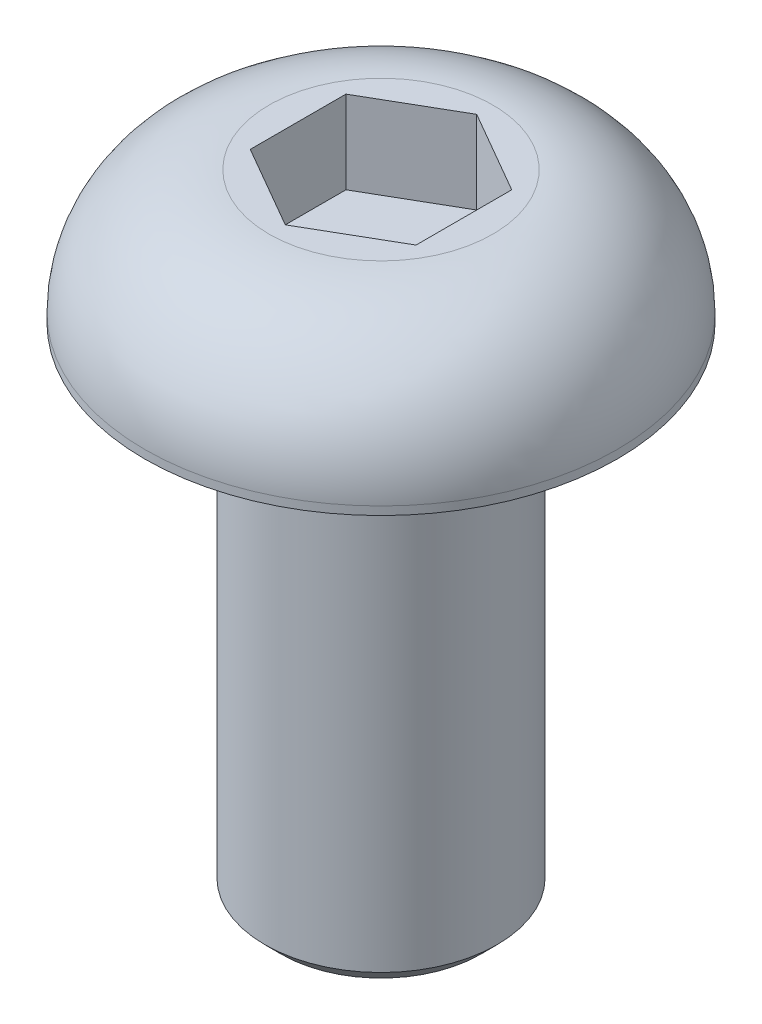
ISO-10303-21;
HEADER;
FILE_DESCRIPTION(('STEP AP214'),'2;1');
FILE_NAME('part.step','',(''),(''),'','','');
FILE_SCHEMA(('AUTOMOTIVE_DESIGN { 1 0 10303 214 1 1 1 1 }'));
ENDSEC;
DATA;
#1=APPLICATION_CONTEXT('core data for automotive mechanical design processes');
#2=APPLICATION_PROTOCOL_DEFINITION('international standard','automotive_design',2000,#1);
#3=PRODUCT_CONTEXT('',#1,'mechanical');
#4=PRODUCT('Part','Part','',(#3));
#5=PRODUCT_RELATED_PRODUCT_CATEGORY('part','',(#4));
#6=PRODUCT_DEFINITION_FORMATION('','',#4);
#7=PRODUCT_DEFINITION_CONTEXT('part definition',#1,'design');
#8=PRODUCT_DEFINITION('design','',#6,#7);
#9=PRODUCT_DEFINITION_SHAPE('','',#8);
#10=(LENGTH_UNIT() NAMED_UNIT(*) SI_UNIT(.MILLI.,.METRE.));
#11=(NAMED_UNIT(*) PLANE_ANGLE_UNIT() SI_UNIT($,.RADIAN.));
#12=(NAMED_UNIT(*) SI_UNIT($,.STERADIAN.) SOLID_ANGLE_UNIT());
#13=UNCERTAINTY_MEASURE_WITH_UNIT(LENGTH_MEASURE(1.E-05),#10,'distance_accuracy_value','');
#14=(GEOMETRIC_REPRESENTATION_CONTEXT(3) GLOBAL_UNCERTAINTY_ASSIGNED_CONTEXT((#13)) GLOBAL_UNIT_ASSIGNED_CONTEXT((#10,
#11,#12)) REPRESENTATION_CONTEXT('',''));
#15=CARTESIAN_POINT('',(0.,0.,0.));
#16=DIRECTION('',(0.,0.,1.));
#17=DIRECTION('',(1.,0.,0.));
#18=AXIS2_PLACEMENT_3D('',#15,#16,#17);
#19=CARTESIAN_POINT('',(0.,1.6,0.));
#20=DIRECTION('',(0.,-1.,0.));
#21=DIRECTION('',(0.,0.,-1.));
#22=AXIS2_PLACEMENT_3D('',#19,#20,#21);
#23=CYLINDRICAL_SURFACE('',#22,2.85);
#24=CARTESIAN_POINT('',(0.,0.1,0.));
#25=DIRECTION('',(0.,1.,0.));
#26=DIRECTION('',(0.,0.,1.));
#27=AXIS2_PLACEMENT_3D('',#24,#25,#26);
#28=CIRCLE('',#27,2.85);
#29=CARTESIAN_POINT('',(0.,0.1,2.85));
#30=VERTEX_POINT('',#29);
#31=EDGE_CURVE('E152',#30,#30,#28,.F.);
#32=ORIENTED_EDGE('',*,*,#31,.T.);
#33=EDGE_LOOP('',(#32));
#34=FACE_BOUND('',#33,.T.);
#35=CARTESIAN_POINT('',(0.,0.,0.));
#36=DIRECTION('',(0.,1.,0.));
#37=DIRECTION('',(0.,0.,1.));
#38=AXIS2_PLACEMENT_3D('',#35,#36,#37);
#39=CIRCLE('',#38,2.85);
#40=CARTESIAN_POINT('',(0.,0.,2.85));
#41=VERTEX_POINT('',#40);
#42=EDGE_CURVE('E141',#41,#41,#39,.T.);
#43=ORIENTED_EDGE('',*,*,#42,.T.);
#44=EDGE_LOOP('',(#43));
#45=FACE_BOUND('',#44,.T.);
#46=ADVANCED_FACE('F38',(#34,#45),#23,.T.);
#47=CARTESIAN_POINT('',(0.,1.6,0.));
#48=DIRECTION('',(0.,1.,0.));
#49=DIRECTION('',(0.,0.,1.));
#50=AXIS2_PLACEMENT_3D('',#47,#48,#49);
#51=PLANE('',#50);
#52=CARTESIAN_POINT('',(0.,1.6,0.));
#53=DIRECTION('',(0.,1.,0.));
#54=DIRECTION('',(0.,0.,1.));
#55=AXIS2_PLACEMENT_3D('',#52,#53,#54);
#56=CIRCLE('',#55,1.35);
#57=CARTESIAN_POINT('',(0.,1.6,1.35));
#58=VERTEX_POINT('',#57);
#59=EDGE_CURVE('E149',#58,#58,#56,.T.);
#60=ORIENTED_EDGE('',*,*,#59,.T.);
#61=EDGE_LOOP('',(#60));
#62=FACE_BOUND('',#61,.T.);
#63=DIRECTION('',(0.866025403784439,0.,0.5));
#64=VECTOR('',#63,1.);
#65=CARTESIAN_POINT('',(-1.,1.6,0.577350269189626));
#66=LINE('',#65,#64);
#67=CARTESIAN_POINT('',(-1.,1.6,0.577350269189626));
#68=VERTEX_POINT('',#67);
#69=CARTESIAN_POINT('',(0.,1.6,1.15470053837925));
#70=VERTEX_POINT('',#69);
#71=EDGE_CURVE('E54',#68,#70,#66,.T.);
#72=ORIENTED_EDGE('',*,*,#71,.F.);
#73=DIRECTION('',(0.,0.,1.));
#74=VECTOR('',#73,1.);
#75=CARTESIAN_POINT('',(-1.,1.6,-0.577350269189626));
#76=LINE('',#75,#74);
#77=CARTESIAN_POINT('',(-1.,1.6,-0.577350269189626));
#78=VERTEX_POINT('',#77);
#79=EDGE_CURVE('E137',#78,#68,#76,.T.);
#80=ORIENTED_EDGE('',*,*,#79,.F.);
#81=DIRECTION('',(-0.866025403784438,0.,0.5));
#82=VECTOR('',#81,1.);
#83=CARTESIAN_POINT('',(0.,1.6,-1.15470053837925));
#84=LINE('',#83,#82);
#85=CARTESIAN_POINT('',(0.,1.6,-1.15470053837925));
#86=VERTEX_POINT('',#85);
#87=EDGE_CURVE('E135',#86,#78,#84,.T.);
#88=ORIENTED_EDGE('',*,*,#87,.F.);
#89=DIRECTION('',(-0.866025403784439,0.,-0.5));
#90=VECTOR('',#89,1.);
#91=CARTESIAN_POINT('',(1.,1.6,-0.577350269189626));
#92=LINE('',#91,#90);
#93=CARTESIAN_POINT('',(1.,1.6,-0.577350269189626));
#94=VERTEX_POINT('',#93);
#95=EDGE_CURVE('E102',#94,#86,#92,.T.);
#96=ORIENTED_EDGE('',*,*,#95,.F.);
#97=DIRECTION('',(0.,0.,-1.));
#98=VECTOR('',#97,1.);
#99=CARTESIAN_POINT('',(1.,1.6,0.577350269189626));
#100=LINE('',#99,#98);
#101=CARTESIAN_POINT('',(1.,1.6,0.577350269189626));
#102=VERTEX_POINT('',#101);
#103=EDGE_CURVE('E131',#102,#94,#100,.T.);
#104=ORIENTED_EDGE('',*,*,#103,.F.);
#105=DIRECTION('',(0.866025403784439,0.,-0.5));
#106=VECTOR('',#105,1.);
#107=CARTESIAN_POINT('',(0.,1.6,1.15470053837925));
#108=LINE('',#107,#106);
#109=EDGE_CURVE('E128',#70,#102,#108,.T.);
#110=ORIENTED_EDGE('',*,*,#109,.F.);
#111=EDGE_LOOP('',(#72,#80,#88,#96,#104,#110));
#112=FACE_BOUND('',#111,.T.);
#113=ADVANCED_FACE('F170',(#62,#112),#51,.T.);
#114=CARTESIAN_POINT('',(0.,0.,0.));
#115=DIRECTION('',(0.,1.,0.));
#116=DIRECTION('',(0.,0.,1.));
#117=AXIS2_PLACEMENT_3D('',#114,#115,#116);
#118=PLANE('',#117);
#119=CARTESIAN_POINT('',(0.,0.,0.));
#120=DIRECTION('',(0.,-1.,0.));
#121=DIRECTION('',(0.,0.,-1.));
#122=AXIS2_PLACEMENT_3D('',#119,#120,#121);
#123=CIRCLE('',#122,1.4);
#124=CARTESIAN_POINT('',(0.,0.,-1.4));
#125=VERTEX_POINT('',#124);
#126=EDGE_CURVE('E154',#125,#125,#123,.T.);
#127=ORIENTED_EDGE('',*,*,#126,.F.);
#128=EDGE_LOOP('',(#127));
#129=FACE_BOUND('',#128,.T.);
#130=ORIENTED_EDGE('',*,*,#42,.F.);
#131=EDGE_LOOP('',(#130));
#132=FACE_BOUND('',#131,.T.);
#133=ADVANCED_FACE('F181',(#129,#132),#118,.F.);
#134=CARTESIAN_POINT('',(-1.,0.6,0.577350269189626));
#135=DIRECTION('',(-0.5,0.,0.866025403784439));
#136=DIRECTION('',(0.866025403784439,0.,0.5));
#137=AXIS2_PLACEMENT_3D('',#134,#135,#136);
#138=PLANE('',#137);
#139=ORIENTED_EDGE('',*,*,#71,.T.);
#140=DIRECTION('',(0.,1.,0.));
#141=VECTOR('',#140,1.);
#142=CARTESIAN_POINT('',(0.,0.6,1.15470053837925));
#143=LINE('',#142,#141);
#144=CARTESIAN_POINT('',(0.,0.6,1.15470053837925));
#145=VERTEX_POINT('',#144);
#146=EDGE_CURVE('E84',#145,#70,#143,.T.);
#147=ORIENTED_EDGE('',*,*,#146,.F.);
#148=DIRECTION('',(0.866025403784439,0.,0.5));
#149=VECTOR('',#148,1.);
#150=CARTESIAN_POINT('',(-1.,0.6,0.577350269189626));
#151=LINE('',#150,#149);
#152=CARTESIAN_POINT('',(-1.,0.6,0.577350269189626));
#153=VERTEX_POINT('',#152);
#154=EDGE_CURVE('E139',#153,#145,#151,.T.);
#155=ORIENTED_EDGE('',*,*,#154,.F.);
#156=DIRECTION('',(0.,1.,0.));
#157=VECTOR('',#156,1.);
#158=CARTESIAN_POINT('',(-1.,0.6,0.577350269189626));
#159=LINE('',#158,#157);
#160=EDGE_CURVE('E62',#153,#68,#159,.T.);
#161=ORIENTED_EDGE('',*,*,#160,.T.);
#162=EDGE_LOOP('',(#139,#147,#155,#161));
#163=FACE_BOUND('',#162,.T.);
#164=ADVANCED_FACE('F174',(#163),#138,.F.);
#165=CARTESIAN_POINT('',(-1.,0.6,-0.577350269189626));
#166=DIRECTION('',(-1.,0.,0.));
#167=DIRECTION('',(0.,0.,1.));
#168=AXIS2_PLACEMENT_3D('',#165,#166,#167);
#169=PLANE('',#168);
#170=ORIENTED_EDGE('',*,*,#79,.T.);
#171=ORIENTED_EDGE('',*,*,#160,.F.);
#172=DIRECTION('',(0.,0.,1.));
#173=VECTOR('',#172,1.);
#174=CARTESIAN_POINT('',(-1.,0.6,-0.577350269189626));
#175=LINE('',#174,#173);
#176=CARTESIAN_POINT('',(-1.,0.6,-0.577350269189626));
#177=VERTEX_POINT('',#176);
#178=EDGE_CURVE('E114',#177,#153,#175,.T.);
#179=ORIENTED_EDGE('',*,*,#178,.F.);
#180=DIRECTION('',(0.,1.,0.));
#181=VECTOR('',#180,1.);
#182=CARTESIAN_POINT('',(-1.,0.6,-0.577350269189626));
#183=LINE('',#182,#181);
#184=EDGE_CURVE('E106',#177,#78,#183,.T.);
#185=ORIENTED_EDGE('',*,*,#184,.T.);
#186=EDGE_LOOP('',(#170,#171,#179,#185));
#187=FACE_BOUND('',#186,.T.);
#188=ADVANCED_FACE('F172',(#187),#169,.F.);
#189=CARTESIAN_POINT('',(0.,0.6,-1.15470053837925));
#190=DIRECTION('',(-0.5,0.,-0.866025403784439));
#191=DIRECTION('',(-0.866025403784439,0.,0.5));
#192=AXIS2_PLACEMENT_3D('',#189,#190,#191);
#193=PLANE('',#192);
#194=ORIENTED_EDGE('',*,*,#87,.T.);
#195=ORIENTED_EDGE('',*,*,#184,.F.);
#196=DIRECTION('',(-0.866025403784438,0.,0.5));
#197=VECTOR('',#196,1.);
#198=CARTESIAN_POINT('',(0.,0.6,-1.15470053837925));
#199=LINE('',#198,#197);
#200=CARTESIAN_POINT('',(0.,0.6,-1.15470053837925));
#201=VERTEX_POINT('',#200);
#202=EDGE_CURVE('E110',#201,#177,#199,.T.);
#203=ORIENTED_EDGE('',*,*,#202,.F.);
#204=DIRECTION('',(0.,1.,0.));
#205=VECTOR('',#204,1.);
#206=CARTESIAN_POINT('',(0.,0.6,-1.15470053837925));
#207=LINE('',#206,#205);
#208=EDGE_CURVE('E95',#201,#86,#207,.T.);
#209=ORIENTED_EDGE('',*,*,#208,.T.);
#210=EDGE_LOOP('',(#194,#195,#203,#209));
#211=FACE_BOUND('',#210,.T.);
#212=ADVANCED_FACE('F111',(#211),#193,.F.);
#213=CARTESIAN_POINT('',(1.,0.6,-0.577350269189626));
#214=DIRECTION('',(0.5,0.,-0.866025403784439));
#215=DIRECTION('',(-0.866025403784439,0.,-0.5));
#216=AXIS2_PLACEMENT_3D('',#213,#214,#215);
#217=PLANE('',#216);
#218=ORIENTED_EDGE('',*,*,#95,.T.);
#219=ORIENTED_EDGE('',*,*,#208,.F.);
#220=DIRECTION('',(-0.866025403784439,0.,-0.5));
#221=VECTOR('',#220,1.);
#222=CARTESIAN_POINT('',(1.,0.6,-0.577350269189626));
#223=LINE('',#222,#221);
#224=CARTESIAN_POINT('',(1.,0.6,-0.577350269189626));
#225=VERTEX_POINT('',#224);
#226=EDGE_CURVE('E99',#225,#201,#223,.T.);
#227=ORIENTED_EDGE('',*,*,#226,.F.);
#228=DIRECTION('',(0.,1.,0.));
#229=VECTOR('',#228,1.);
#230=CARTESIAN_POINT('',(1.,0.6,-0.577350269189626));
#231=LINE('',#230,#229);
#232=EDGE_CURVE('E107',#225,#94,#231,.T.);
#233=ORIENTED_EDGE('',*,*,#232,.T.);
#234=EDGE_LOOP('',(#218,#219,#227,#233));
#235=FACE_BOUND('',#234,.T.);
#236=ADVANCED_FACE('F97',(#235),#217,.F.);
#237=CARTESIAN_POINT('',(1.,0.6,0.577350269189626));
#238=DIRECTION('',(1.,0.,0.));
#239=DIRECTION('',(0.,0.,-1.));
#240=AXIS2_PLACEMENT_3D('',#237,#238,#239);
#241=PLANE('',#240);
#242=ORIENTED_EDGE('',*,*,#103,.T.);
#243=ORIENTED_EDGE('',*,*,#232,.F.);
#244=DIRECTION('',(0.,0.,-1.));
#245=VECTOR('',#244,1.);
#246=CARTESIAN_POINT('',(1.,0.6,0.577350269189626));
#247=LINE('',#246,#245);
#248=CARTESIAN_POINT('',(1.,0.6,0.577350269189626));
#249=VERTEX_POINT('',#248);
#250=EDGE_CURVE('E120',#249,#225,#247,.T.);
#251=ORIENTED_EDGE('',*,*,#250,.F.);
#252=DIRECTION('',(0.,1.,0.));
#253=VECTOR('',#252,1.);
#254=CARTESIAN_POINT('',(1.,0.6,0.577350269189626));
#255=LINE('',#254,#253);
#256=EDGE_CURVE('E144',#249,#102,#255,.T.);
#257=ORIENTED_EDGE('',*,*,#256,.T.);
#258=EDGE_LOOP('',(#242,#243,#251,#257));
#259=FACE_BOUND('',#258,.T.);
#260=ADVANCED_FACE('F168',(#259),#241,.F.);
#261=CARTESIAN_POINT('',(0.,0.6,1.15470053837925));
#262=DIRECTION('',(0.5,0.,0.866025403784439));
#263=DIRECTION('',(0.866025403784439,0.,-0.5));
#264=AXIS2_PLACEMENT_3D('',#261,#262,#263);
#265=PLANE('',#264);
#266=ORIENTED_EDGE('',*,*,#109,.T.);
#267=ORIENTED_EDGE('',*,*,#256,.F.);
#268=DIRECTION('',(0.866025403784439,0.,-0.5));
#269=VECTOR('',#268,1.);
#270=CARTESIAN_POINT('',(0.,0.6,1.15470053837925));
#271=LINE('',#270,#269);
#272=EDGE_CURVE('E122',#145,#249,#271,.T.);
#273=ORIENTED_EDGE('',*,*,#272,.F.);
#274=ORIENTED_EDGE('',*,*,#146,.T.);
#275=EDGE_LOOP('',(#266,#267,#273,#274));
#276=FACE_BOUND('',#275,.T.);
#277=ADVANCED_FACE('F164',(#276),#265,.F.);
#278=CARTESIAN_POINT('',(0.,0.6,0.));
#279=DIRECTION('',(0.,1.,0.));
#280=DIRECTION('',(0.,0.,1.));
#281=AXIS2_PLACEMENT_3D('',#278,#279,#280);
#282=PLANE('',#281);
#283=ORIENTED_EDGE('',*,*,#154,.T.);
#284=ORIENTED_EDGE('',*,*,#272,.T.);
#285=ORIENTED_EDGE('',*,*,#250,.T.);
#286=ORIENTED_EDGE('',*,*,#226,.T.);
#287=ORIENTED_EDGE('',*,*,#202,.T.);
#288=ORIENTED_EDGE('',*,*,#178,.T.);
#289=EDGE_LOOP('',(#283,#284,#285,#286,#287,#288));
#290=FACE_BOUND('',#289,.T.);
#291=ADVANCED_FACE('F117',(#290),#282,.T.);
#292=CARTESIAN_POINT('',(0.,0.1,0.));
#293=DIRECTION('',(0.,1.,0.));
#294=DIRECTION('',(0.,0.,1.));
#295=AXIS2_PLACEMENT_3D('',#292,#293,#294);
#296=DEGENERATE_TOROIDAL_SURFACE('',#295,1.35,1.5,.T.);
#297=ORIENTED_EDGE('',*,*,#31,.F.);
#298=EDGE_LOOP('',(#297));
#299=FACE_BOUND('',#298,.T.);
#300=ORIENTED_EDGE('',*,*,#59,.F.);
#301=EDGE_LOOP('',(#300));
#302=FACE_BOUND('',#301,.T.);
#303=ADVANCED_FACE('F194',(#299,#302),#296,.T.);
#304=CARTESIAN_POINT('',(0.,-6.,0.));
#305=DIRECTION('',(0.,1.,0.));
#306=DIRECTION('',(0.,0.,1.));
#307=AXIS2_PLACEMENT_3D('',#304,#305,#306);
#308=CYLINDRICAL_SURFACE('',#307,1.4);
#309=CARTESIAN_POINT('',(0.,-5.8,0.));
#310=DIRECTION('',(0.,-1.,0.));
#311=DIRECTION('',(0.,0.,-1.));
#312=AXIS2_PLACEMENT_3D('',#309,#310,#311);
#313=CIRCLE('',#312,1.4);
#314=CARTESIAN_POINT('',(0.,-5.8,-1.4));
#315=VERTEX_POINT('',#314);
#316=EDGE_CURVE('E11',#315,#315,#313,.F.);
#317=ORIENTED_EDGE('',*,*,#316,.T.);
#318=EDGE_LOOP('',(#317));
#319=FACE_BOUND('',#318,.T.);
#320=ORIENTED_EDGE('',*,*,#126,.T.);
#321=EDGE_LOOP('',(#320));
#322=FACE_BOUND('',#321,.T.);
#323=ADVANCED_FACE('F196',(#319,#322),#308,.T.);
#324=CARTESIAN_POINT('',(0.,-6.,0.));
#325=DIRECTION('',(0.,-1.,0.));
#326=DIRECTION('',(0.,0.,-1.));
#327=AXIS2_PLACEMENT_3D('',#324,#325,#326);
#328=PLANE('',#327);
#329=CARTESIAN_POINT('',(0.,-6.,0.));
#330=DIRECTION('',(0.,-1.,0.));
#331=DIRECTION('',(0.,0.,-1.));
#332=AXIS2_PLACEMENT_3D('',#329,#330,#331);
#333=CIRCLE('',#332,1.2);
#334=CARTESIAN_POINT('',(0.,-6.,-1.2));
#335=VERTEX_POINT('',#334);
#336=EDGE_CURVE('E47',#335,#335,#333,.T.);
#337=ORIENTED_EDGE('',*,*,#336,.T.);
#338=EDGE_LOOP('',(#337));
#339=FACE_BOUND('',#338,.T.);
#340=ADVANCED_FACE('F202',(#339),#328,.T.);
#341=CARTESIAN_POINT('',(0.,-6.,0.));
#342=DIRECTION('',(0.,1.,0.));
#343=DIRECTION('',(0.,0.,1.));
#344=AXIS2_PLACEMENT_3D('',#341,#342,#343);
#345=CONICAL_SURFACE('',#344,1.2,0.78539816339745);
#346=ORIENTED_EDGE('',*,*,#316,.F.);
#347=EDGE_LOOP('',(#346));
#348=FACE_BOUND('',#347,.T.);
#349=ORIENTED_EDGE('',*,*,#336,.F.);
#350=EDGE_LOOP('',(#349));
#351=FACE_BOUND('',#350,.T.);
#352=ADVANCED_FACE('F41',(#348,#351),#345,.T.);
#353=CLOSED_SHELL('',(#46,#113,#133,#164,#188,#212,#236,#260,#277,#291,#303,#323,#340,#352));
#354=MANIFOLD_SOLID_BREP('B2',#353);
#355=ADVANCED_BREP_SHAPE_REPRESENTATION('',(#18,#354),#14);
#356=SHAPE_DEFINITION_REPRESENTATION(#9,#355);
ENDSEC;
END-ISO-10303-21;
